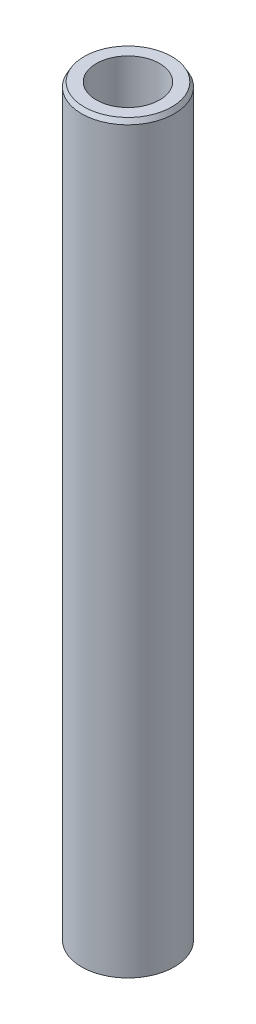
ISO-10303-21;
HEADER;
FILE_DESCRIPTION(('STEP AP214'),'2;1');
FILE_NAME('part.step','',(''),(''),'','','');
FILE_SCHEMA(('AUTOMOTIVE_DESIGN { 1 0 10303 214 1 1 1 1 }'));
ENDSEC;
DATA;
#1=APPLICATION_CONTEXT('core data for automotive mechanical design processes');
#2=APPLICATION_PROTOCOL_DEFINITION('international standard','automotive_design',2000,#1);
#3=PRODUCT_CONTEXT('',#1,'mechanical');
#4=PRODUCT('Part','Part','',(#3));
#5=PRODUCT_RELATED_PRODUCT_CATEGORY('part','',(#4));
#6=PRODUCT_DEFINITION_FORMATION('','',#4);
#7=PRODUCT_DEFINITION_CONTEXT('part definition',#1,'design');
#8=PRODUCT_DEFINITION('design','',#6,#7);
#9=PRODUCT_DEFINITION_SHAPE('','',#8);
#10=(LENGTH_UNIT() NAMED_UNIT(*) SI_UNIT(.MILLI.,.METRE.));
#11=(NAMED_UNIT(*) PLANE_ANGLE_UNIT() SI_UNIT($,.RADIAN.));
#12=(NAMED_UNIT(*) SI_UNIT($,.STERADIAN.) SOLID_ANGLE_UNIT());
#13=UNCERTAINTY_MEASURE_WITH_UNIT(LENGTH_MEASURE(1.E-05),#10,'distance_accuracy_value','');
#14=(GEOMETRIC_REPRESENTATION_CONTEXT(3) GLOBAL_UNCERTAINTY_ASSIGNED_CONTEXT((#13)) GLOBAL_UNIT_ASSIGNED_CONTEXT((#10,
#11,#12)) REPRESENTATION_CONTEXT('',''));
#15=CARTESIAN_POINT('',(0.,0.,0.));
#16=DIRECTION('',(0.,0.,1.));
#17=DIRECTION('',(1.,0.,0.));
#18=AXIS2_PLACEMENT_3D('',#15,#16,#17);
#19=CARTESIAN_POINT('',(0.,442.302149109716,0.));
#20=DIRECTION('',(0.,-1.,0.));
#21=DIRECTION('',(0.,0.,-1.));
#22=AXIS2_PLACEMENT_3D('',#19,#20,#21);
#23=CYLINDRICAL_SURFACE('',#22,27.5);
#24=CARTESIAN_POINT('',(0.,439.612609653335,0.));
#25=DIRECTION('',(0.,1.,0.));
#26=DIRECTION('',(0.,0.,1.));
#27=AXIS2_PLACEMENT_3D('',#24,#25,#26);
#28=CIRCLE('',#27,27.5);
#29=CARTESIAN_POINT('',(0.,439.612609653335,27.5));
#30=VERTEX_POINT('',#29);
#31=EDGE_CURVE('E50',#30,#30,#28,.F.);
#32=ORIENTED_EDGE('',*,*,#31,.T.);
#33=EDGE_LOOP('',(#32));
#34=FACE_BOUND('',#33,.T.);
#35=CARTESIAN_POINT('',(0.,1.55280632913762,0.));
#36=DIRECTION('',(0.,1.,0.));
#37=DIRECTION('',(0.,0.,1.));
#38=AXIS2_PLACEMENT_3D('',#35,#36,#37);
#39=CIRCLE('',#38,27.5);
#40=CARTESIAN_POINT('',(0.,1.55280632913762,27.5));
#41=VERTEX_POINT('',#40);
#42=EDGE_CURVE('E51',#41,#41,#39,.T.);
#43=ORIENTED_EDGE('',*,*,#42,.T.);
#44=EDGE_LOOP('',(#43));
#45=FACE_BOUND('',#44,.T.);
#46=ADVANCED_FACE('F39',(#34,#45),#23,.T.);
#47=CARTESIAN_POINT('',(0.,442.302149109716,0.));
#48=DIRECTION('',(0.,1.,0.));
#49=DIRECTION('',(0.,0.,1.));
#50=AXIS2_PLACEMENT_3D('',#47,#48,#49);
#51=PLANE('',#50);
#52=CARTESIAN_POINT('',(0.,442.302149109716,0.));
#53=DIRECTION('',(0.,1.,0.));
#54=DIRECTION('',(0.,0.,1.));
#55=AXIS2_PLACEMENT_3D('',#52,#53,#54);
#56=CIRCLE('',#55,25.9471936708623);
#57=CARTESIAN_POINT('',(0.,442.302149109716,25.9471936708623));
#58=VERTEX_POINT('',#57);
#59=EDGE_CURVE('E54',#58,#58,#56,.T.);
#60=ORIENTED_EDGE('',*,*,#59,.T.);
#61=EDGE_LOOP('',(#60));
#62=FACE_BOUND('',#61,.T.);
#63=CARTESIAN_POINT('',(0.,442.302149109716,0.));
#64=DIRECTION('',(0.,1.,0.));
#65=DIRECTION('',(0.,0.,1.));
#66=AXIS2_PLACEMENT_3D('',#63,#64,#65);
#67=CIRCLE('',#66,18.7576219610978);
#68=CARTESIAN_POINT('',(0.,442.302149109716,18.7576219610978));
#69=VERTEX_POINT('',#68);
#70=EDGE_CURVE('E58',#69,#69,#67,.T.);
#71=ORIENTED_EDGE('',*,*,#70,.F.);
#72=EDGE_LOOP('',(#71));
#73=FACE_BOUND('',#72,.T.);
#74=ADVANCED_FACE('F69',(#62,#73),#51,.T.);
#75=CARTESIAN_POINT('',(0.,0.,0.));
#76=DIRECTION('',(0.,1.,0.));
#77=DIRECTION('',(0.,0.,1.));
#78=AXIS2_PLACEMENT_3D('',#75,#76,#77);
#79=PLANE('',#78);
#80=CARTESIAN_POINT('',(0.,0.,0.));
#81=DIRECTION('',(0.,1.,0.));
#82=DIRECTION('',(0.,0.,1.));
#83=AXIS2_PLACEMENT_3D('',#80,#81,#82);
#84=CIRCLE('',#83,24.8104605436191);
#85=CARTESIAN_POINT('',(0.,0.,24.8104605436191));
#86=VERTEX_POINT('',#85);
#87=EDGE_CURVE('E10',#86,#86,#84,.F.);
#88=ORIENTED_EDGE('',*,*,#87,.T.);
#89=EDGE_LOOP('',(#88));
#90=FACE_BOUND('',#89,.T.);
#91=CARTESIAN_POINT('',(0.,0.,0.));
#92=DIRECTION('',(0.,1.,0.));
#93=DIRECTION('',(0.,0.,1.));
#94=AXIS2_PLACEMENT_3D('',#91,#92,#93);
#95=CIRCLE('',#94,18.7576219610978);
#96=CARTESIAN_POINT('',(0.,0.,18.7576219610978));
#97=VERTEX_POINT('',#96);
#98=EDGE_CURVE('E63',#97,#97,#95,.T.);
#99=ORIENTED_EDGE('',*,*,#98,.T.);
#100=EDGE_LOOP('',(#99));
#101=FACE_BOUND('',#100,.T.);
#102=ADVANCED_FACE('F75',(#90,#101),#79,.F.);
#103=CARTESIAN_POINT('',(0.,442.302149109716,0.));
#104=DIRECTION('',(0.,-1.,0.));
#105=DIRECTION('',(0.,0.,-1.));
#106=AXIS2_PLACEMENT_3D('',#103,#104,#105);
#107=CYLINDRICAL_SURFACE('',#106,18.7576219610978);
#108=ORIENTED_EDGE('',*,*,#70,.T.);
#109=EDGE_LOOP('',(#108));
#110=FACE_BOUND('',#109,.T.);
#111=ORIENTED_EDGE('',*,*,#98,.F.);
#112=EDGE_LOOP('',(#111));
#113=FACE_BOUND('',#112,.T.);
#114=ADVANCED_FACE('F70',(#110,#113),#107,.F.);
#115=CARTESIAN_POINT('',(0.,442.302149109716,0.));
#116=DIRECTION('',(0.,-1.,0.));
#117=DIRECTION('',(0.,0.,-1.));
#118=AXIS2_PLACEMENT_3D('',#115,#116,#117);
#119=CONICAL_SURFACE('',#118,25.9471936708623,0.523598775598304);
#120=ORIENTED_EDGE('',*,*,#31,.F.);
#121=EDGE_LOOP('',(#120));
#122=FACE_BOUND('',#121,.T.);
#123=ORIENTED_EDGE('',*,*,#59,.F.);
#124=EDGE_LOOP('',(#123));
#125=FACE_BOUND('',#124,.T.);
#126=ADVANCED_FACE('F81',(#122,#125),#119,.T.);
#127=CARTESIAN_POINT('',(0.,1.55280632913762,0.));
#128=DIRECTION('',(0.,1.,0.));
#129=DIRECTION('',(0.,0.,1.));
#130=AXIS2_PLACEMENT_3D('',#127,#128,#129);
#131=CONICAL_SURFACE('',#130,27.5,1.04719755119661);
#132=ORIENTED_EDGE('',*,*,#87,.F.);
#133=EDGE_LOOP('',(#132));
#134=FACE_BOUND('',#133,.T.);
#135=ORIENTED_EDGE('',*,*,#42,.F.);
#136=EDGE_LOOP('',(#135));
#137=FACE_BOUND('',#136,.T.);
#138=ADVANCED_FACE('F45',(#134,#137),#131,.T.);
#139=CLOSED_SHELL('',(#46,#74,#102,#114,#126,#138));
#140=MANIFOLD_SOLID_BREP('B2',#139);
#141=ADVANCED_BREP_SHAPE_REPRESENTATION('',(#18,#140),#14);
#142=SHAPE_DEFINITION_REPRESENTATION(#9,#141);
ENDSEC;
END-ISO-10303-21;
